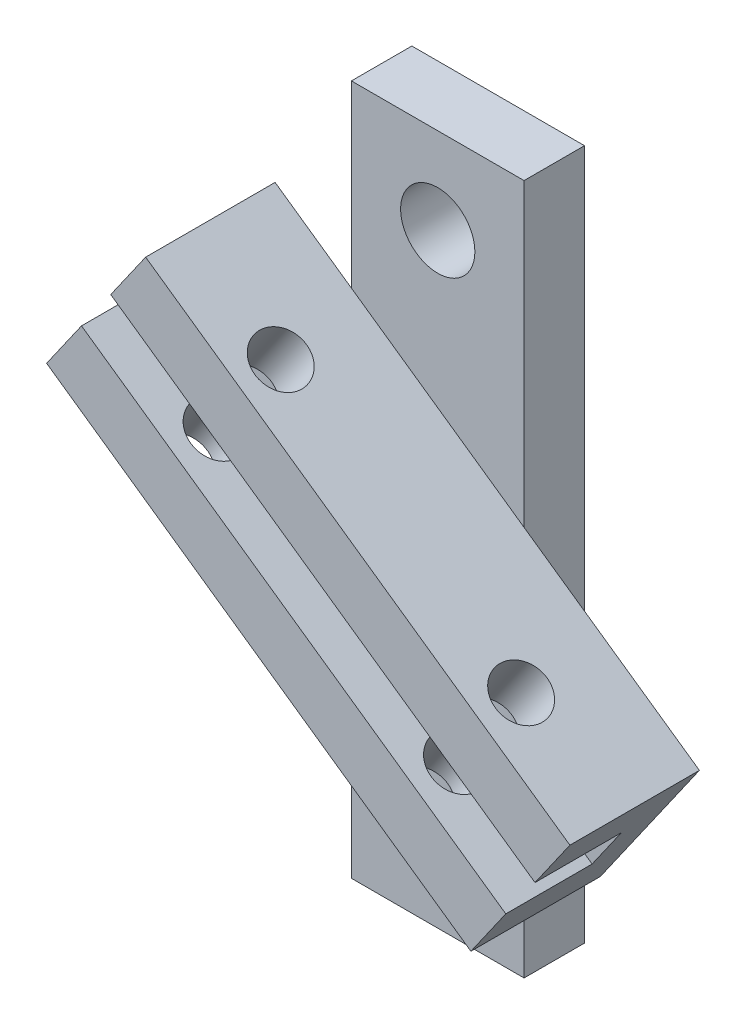
ISO-10303-21;
HEADER;
FILE_DESCRIPTION(('STEP AP214'),'2;1');
FILE_NAME('part.step','',(''),(''),'','','');
FILE_SCHEMA(('AUTOMOTIVE_DESIGN { 1 0 10303 214 1 1 1 1 }'));
ENDSEC;
DATA;
#1=APPLICATION_CONTEXT('core data for automotive mechanical design processes');
#2=APPLICATION_PROTOCOL_DEFINITION('international standard','automotive_design',2000,#1);
#3=PRODUCT_CONTEXT('',#1,'mechanical');
#4=PRODUCT('Part','Part','',(#3));
#5=PRODUCT_RELATED_PRODUCT_CATEGORY('part','',(#4));
#6=PRODUCT_DEFINITION_FORMATION('','',#4);
#7=PRODUCT_DEFINITION_CONTEXT('part definition',#1,'design');
#8=PRODUCT_DEFINITION('design','',#6,#7);
#9=PRODUCT_DEFINITION_SHAPE('','',#8);
#10=(LENGTH_UNIT() NAMED_UNIT(*) SI_UNIT(.MILLI.,.METRE.));
#11=(NAMED_UNIT(*) PLANE_ANGLE_UNIT() SI_UNIT($,.RADIAN.));
#12=(NAMED_UNIT(*) SI_UNIT($,.STERADIAN.) SOLID_ANGLE_UNIT());
#13=UNCERTAINTY_MEASURE_WITH_UNIT(LENGTH_MEASURE(1.E-05),#10,'distance_accuracy_value','');
#14=(GEOMETRIC_REPRESENTATION_CONTEXT(3) GLOBAL_UNCERTAINTY_ASSIGNED_CONTEXT((#13)) GLOBAL_UNIT_ASSIGNED_CONTEXT((#10,
#11,#12)) REPRESENTATION_CONTEXT('',''));
#15=CARTESIAN_POINT('',(0.,0.,0.));
#16=DIRECTION('',(0.,0.,1.));
#17=DIRECTION('',(1.,0.,0.));
#18=AXIS2_PLACEMENT_3D('',#15,#16,#17);
#19=CARTESIAN_POINT('',(0.,0.,22.));
#20=DIRECTION('',(0.,0.,1.));
#21=DIRECTION('',(1.,0.,0.));
#22=AXIS2_PLACEMENT_3D('',#19,#20,#21);
#23=PLANE('',#22);
#24=DIRECTION('',(-0.819152044288995,0.573576436351041,0.));
#25=VECTOR('',#24,1.);
#26=CARTESIAN_POINT('',(36.2666118159054,25.2092054401212,22.));
#27=LINE('',#26,#25);
#28=CARTESIAN_POINT('',(36.2666118159054,25.2092054401212,22.));
#29=VERTEX_POINT('',#28);
#30=CARTESIAN_POINT('',(-12.8825108414343,59.6237916211837,22.));
#31=VERTEX_POINT('',#30);
#32=EDGE_CURVE('E154',#29,#31,#27,.T.);
#33=ORIENTED_EDGE('',*,*,#32,.F.);
#34=DIRECTION('',(0.573576436351041,0.819152044288995,0.));
#35=VECTOR('',#34,1.);
#36=CARTESIAN_POINT('',(12.4908096295802,-8.74615906097435,22.));
#37=LINE('',#36,#35);
#38=CARTESIAN_POINT('',(40.3103256921802,30.9842273523587,22.));
#39=VERTEX_POINT('',#38);
#40=EDGE_CURVE('E175',#29,#39,#37,.T.);
#41=ORIENTED_EDGE('',*,*,#40,.T.);
#42=DIRECTION('',(-0.819152044288995,0.573576436351041,0.));
#43=VECTOR('',#42,1.);
#44=CARTESIAN_POINT('',(27.8195160626001,39.730386413333,22.));
#45=LINE('',#44,#43);
#46=CARTESIAN_POINT('',(-8.83879696515949,65.3988135334211,22.));
#47=VERTEX_POINT('',#46);
#48=EDGE_CURVE('E166',#39,#47,#45,.T.);
#49=ORIENTED_EDGE('',*,*,#48,.T.);
#50=DIRECTION('',(-0.573576436351041,-0.819152044288995,0.));
#51=VECTOR('',#50,1.);
#52=CARTESIAN_POINT('',(-36.6583130277595,25.6684271200881,22.));
#53=LINE('',#52,#51);
#54=EDGE_CURVE('E170',#47,#31,#53,.T.);
#55=ORIENTED_EDGE('',*,*,#54,.T.);
#56=EDGE_LOOP('',(#33,#41,#49,#55));
#57=FACE_BOUND('',#56,.T.);
#58=ADVANCED_FACE('F35',(#57),#23,.T.);
#59=CARTESIAN_POINT('',(0.,0.,7.));
#60=DIRECTION('',(0.,0.,-1.));
#61=DIRECTION('',(-1.,0.,0.));
#62=AXIS2_PLACEMENT_3D('',#59,#60,#61);
#63=PLANE('',#62);
#64=CARTESIAN_POINT('',(9.99999999999999,70.,7.));
#65=DIRECTION('',(0.,0.,1.));
#66=DIRECTION('',(1.,0.,0.));
#67=AXIS2_PLACEMENT_3D('',#64,#65,#66);
#68=CIRCLE('',#67,4.3);
#69=CARTESIAN_POINT('',(14.3,70.,7.));
#70=VERTEX_POINT('',#69);
#71=EDGE_CURVE('E206',#70,#70,#68,.T.);
#72=ORIENTED_EDGE('',*,*,#71,.F.);
#73=EDGE_LOOP('',(#72));
#74=FACE_BOUND('',#73,.T.);
#75=DIRECTION('',(-0.819152044288995,0.573576436351041,0.));
#76=VECTOR('',#75,1.);
#77=CARTESIAN_POINT('',(27.8195160626001,39.730386413333,7.));
#78=LINE('',#77,#76);
#79=CARTESIAN_POINT('',(20.,45.2056705055174,7.));
#80=VERTEX_POINT('',#79);
#81=CARTESIAN_POINT('',(0.,59.2098212697114,7.));
#82=VERTEX_POINT('',#81);
#83=EDGE_CURVE('E11',#80,#82,#78,.T.);
#84=ORIENTED_EDGE('',*,*,#83,.F.);
#85=DIRECTION('',(0.,1.,0.));
#86=VECTOR('',#85,1.);
#87=CARTESIAN_POINT('',(20.,0.,7.));
#88=LINE('',#87,#86);
#89=CARTESIAN_POINT('',(20.,80.,7.));
#90=VERTEX_POINT('',#89);
#91=EDGE_CURVE('E218',#80,#90,#88,.T.);
#92=ORIENTED_EDGE('',*,*,#91,.T.);
#93=DIRECTION('',(-1.,0.,0.));
#94=VECTOR('',#93,1.);
#95=CARTESIAN_POINT('',(0.,80.,7.));
#96=LINE('',#95,#94);
#97=CARTESIAN_POINT('',(0.,80.,7.));
#98=VERTEX_POINT('',#97);
#99=EDGE_CURVE('E221',#90,#98,#96,.T.);
#100=ORIENTED_EDGE('',*,*,#99,.T.);
#101=DIRECTION('',(0.,-1.,0.));
#102=VECTOR('',#101,1.);
#103=CARTESIAN_POINT('',(0.,0.,7.));
#104=LINE('',#103,#102);
#105=EDGE_CURVE('E212',#98,#82,#104,.T.);
#106=ORIENTED_EDGE('',*,*,#105,.T.);
#107=EDGE_LOOP('',(#84,#92,#100,#106));
#108=FACE_BOUND('',#107,.T.);
#109=ADVANCED_FACE('F336',(#74,#108),#63,.F.);
#110=CARTESIAN_POINT('',(10.,9.99999999999999,7.));
#111=DIRECTION('',(0.,0.,1.));
#112=DIRECTION('',(-1.,0.,0.));
#113=AXIS2_PLACEMENT_3D('',#110,#111,#112);
#114=CIRCLE('',#113,4.3);
#115=CARTESIAN_POINT('',(5.70000000000001,9.99999999999999,7.));
#116=VERTEX_POINT('',#115);
#117=EDGE_CURVE('E200',#116,#116,#114,.T.);
#118=ORIENTED_EDGE('',*,*,#117,.F.);
#119=EDGE_LOOP('',(#118));
#120=FACE_BOUND('',#119,.T.);
#121=DIRECTION('',(0.819152044288995,-0.573576436351041,0.));
#122=VECTOR('',#121,1.);
#123=CARTESIAN_POINT('',(16.3479873355792,23.3473455275531,7.));
#124=LINE('',#123,#122);
#125=CARTESIAN_POINT('',(0.,34.7943294944824,7.));
#126=VERTEX_POINT('',#125);
#127=CARTESIAN_POINT('',(20.,20.7901787302884,7.));
#128=VERTEX_POINT('',#127);
#129=EDGE_CURVE('E44',#126,#128,#124,.T.);
#130=ORIENTED_EDGE('',*,*,#129,.F.);
#131=CARTESIAN_POINT('',(0.,0.,7.));
#132=VERTEX_POINT('',#131);
#133=EDGE_CURVE('E216',#126,#132,#104,.T.);
#134=ORIENTED_EDGE('',*,*,#133,.T.);
#135=DIRECTION('',(1.,0.,0.));
#136=VECTOR('',#135,1.);
#137=CARTESIAN_POINT('',(0.,0.,7.));
#138=LINE('',#137,#136);
#139=CARTESIAN_POINT('',(20.,0.,7.));
#140=VERTEX_POINT('',#139);
#141=EDGE_CURVE('E214',#132,#140,#138,.T.);
#142=ORIENTED_EDGE('',*,*,#141,.T.);
#143=EDGE_CURVE('E219',#140,#128,#88,.T.);
#144=ORIENTED_EDGE('',*,*,#143,.T.);
#145=EDGE_LOOP('',(#130,#134,#142,#144));
#146=FACE_BOUND('',#145,.T.);
#147=ADVANCED_FACE('F300',(#120,#146),#63,.F.);
#148=CARTESIAN_POINT('',(0.,0.,0.));
#149=DIRECTION('',(0.,0.,-1.));
#150=DIRECTION('',(-1.,0.,0.));
#151=AXIS2_PLACEMENT_3D('',#148,#149,#150);
#152=PLANE('',#151);
#153=CARTESIAN_POINT('',(9.99999999999999,70.,0.));
#154=DIRECTION('',(0.,0.,1.));
#155=DIRECTION('',(1.,0.,0.));
#156=AXIS2_PLACEMENT_3D('',#153,#154,#155);
#157=CIRCLE('',#156,4.3);
#158=CARTESIAN_POINT('',(14.3,70.,0.));
#159=VERTEX_POINT('',#158);
#160=EDGE_CURVE('E203',#159,#159,#157,.T.);
#161=ORIENTED_EDGE('',*,*,#160,.T.);
#162=EDGE_LOOP('',(#161));
#163=FACE_BOUND('',#162,.T.);
#164=DIRECTION('',(0.,-1.,0.));
#165=VECTOR('',#164,1.);
#166=CARTESIAN_POINT('',(0.,0.,0.));
#167=LINE('',#166,#165);
#168=CARTESIAN_POINT('',(0.,80.,0.));
#169=VERTEX_POINT('',#168);
#170=CARTESIAN_POINT('',(0.,0.,0.));
#171=VERTEX_POINT('',#170);
#172=EDGE_CURVE('E209',#169,#171,#167,.T.);
#173=ORIENTED_EDGE('',*,*,#172,.F.);
#174=DIRECTION('',(-1.,0.,0.));
#175=VECTOR('',#174,1.);
#176=CARTESIAN_POINT('',(0.,80.,0.));
#177=LINE('',#176,#175);
#178=CARTESIAN_POINT('',(20.,80.,0.));
#179=VERTEX_POINT('',#178);
#180=EDGE_CURVE('E231',#179,#169,#177,.T.);
#181=ORIENTED_EDGE('',*,*,#180,.F.);
#182=DIRECTION('',(0.,1.,0.));
#183=VECTOR('',#182,1.);
#184=CARTESIAN_POINT('',(20.,0.,0.));
#185=LINE('',#184,#183);
#186=CARTESIAN_POINT('',(20.,0.,0.));
#187=VERTEX_POINT('',#186);
#188=EDGE_CURVE('E229',#187,#179,#185,.T.);
#189=ORIENTED_EDGE('',*,*,#188,.F.);
#190=DIRECTION('',(1.,0.,0.));
#191=VECTOR('',#190,1.);
#192=CARTESIAN_POINT('',(0.,0.,0.));
#193=LINE('',#192,#191);
#194=EDGE_CURVE('E227',#171,#187,#193,.T.);
#195=ORIENTED_EDGE('',*,*,#194,.F.);
#196=EDGE_LOOP('',(#173,#181,#189,#195));
#197=FACE_BOUND('',#196,.T.);
#198=CARTESIAN_POINT('',(10.,9.99999999999999,0.));
#199=DIRECTION('',(0.,0.,1.));
#200=DIRECTION('',(-1.,0.,0.));
#201=AXIS2_PLACEMENT_3D('',#198,#199,#200);
#202=CIRCLE('',#201,4.3);
#203=CARTESIAN_POINT('',(5.70000000000001,9.99999999999999,0.));
#204=VERTEX_POINT('',#203);
#205=EDGE_CURVE('E199',#204,#204,#202,.T.);
#206=ORIENTED_EDGE('',*,*,#205,.T.);
#207=EDGE_LOOP('',(#206));
#208=FACE_BOUND('',#207,.T.);
#209=ADVANCED_FACE('F310',(#163,#197,#208),#152,.T.);
#210=CARTESIAN_POINT('',(0.,0.,7.));
#211=DIRECTION('',(1.,0.,0.));
#212=DIRECTION('',(0.,0.,-1.));
#213=AXIS2_PLACEMENT_3D('',#210,#211,#212);
#214=PLANE('',#213);
#215=ORIENTED_EDGE('',*,*,#172,.T.);
#216=DIRECTION('',(0.,0.,-1.));
#217=VECTOR('',#216,1.);
#218=CARTESIAN_POINT('',(0.,0.,7.));
#219=LINE('',#218,#217);
#220=EDGE_CURVE('E241',#132,#171,#219,.T.);
#221=ORIENTED_EDGE('',*,*,#220,.F.);
#222=ORIENTED_EDGE('',*,*,#133,.F.);
#223=EDGE_CURVE('E215',#82,#126,#104,.T.);
#224=ORIENTED_EDGE('',*,*,#223,.F.);
#225=ORIENTED_EDGE('',*,*,#105,.F.);
#226=DIRECTION('',(0.,0.,-1.));
#227=VECTOR('',#226,1.);
#228=CARTESIAN_POINT('',(0.,80.,7.));
#229=LINE('',#228,#227);
#230=EDGE_CURVE('E224',#98,#169,#229,.T.);
#231=ORIENTED_EDGE('',*,*,#230,.T.);
#232=EDGE_LOOP('',(#215,#221,#222,#224,#225,#231));
#233=FACE_BOUND('',#232,.T.);
#234=ADVANCED_FACE('F37',(#233),#214,.F.);
#235=CARTESIAN_POINT('',(0.,0.,7.));
#236=DIRECTION('',(0.,1.,0.));
#237=DIRECTION('',(0.,0.,1.));
#238=AXIS2_PLACEMENT_3D('',#235,#236,#237);
#239=PLANE('',#238);
#240=ORIENTED_EDGE('',*,*,#194,.T.);
#241=DIRECTION('',(0.,0.,-1.));
#242=VECTOR('',#241,1.);
#243=CARTESIAN_POINT('',(20.,0.,7.));
#244=LINE('',#243,#242);
#245=EDGE_CURVE('E238',#140,#187,#244,.T.);
#246=ORIENTED_EDGE('',*,*,#245,.F.);
#247=ORIENTED_EDGE('',*,*,#141,.F.);
#248=ORIENTED_EDGE('',*,*,#220,.T.);
#249=EDGE_LOOP('',(#240,#246,#247,#248));
#250=FACE_BOUND('',#249,.T.);
#251=ADVANCED_FACE('F304',(#250),#239,.F.);
#252=CARTESIAN_POINT('',(20.,0.,7.));
#253=DIRECTION('',(-1.,0.,0.));
#254=DIRECTION('',(0.,-1.,0.));
#255=AXIS2_PLACEMENT_3D('',#252,#253,#254);
#256=PLANE('',#255);
#257=ORIENTED_EDGE('',*,*,#188,.T.);
#258=DIRECTION('',(0.,0.,-1.));
#259=VECTOR('',#258,1.);
#260=CARTESIAN_POINT('',(20.,80.,7.));
#261=LINE('',#260,#259);
#262=EDGE_CURVE('E235',#90,#179,#261,.T.);
#263=ORIENTED_EDGE('',*,*,#262,.F.);
#264=ORIENTED_EDGE('',*,*,#91,.F.);
#265=EDGE_CURVE('E222',#128,#80,#88,.T.);
#266=ORIENTED_EDGE('',*,*,#265,.F.);
#267=ORIENTED_EDGE('',*,*,#143,.F.);
#268=ORIENTED_EDGE('',*,*,#245,.T.);
#269=EDGE_LOOP('',(#257,#263,#264,#266,#267,#268));
#270=FACE_BOUND('',#269,.T.);
#271=ADVANCED_FACE('F314',(#270),#256,.F.);
#272=CARTESIAN_POINT('',(0.,80.,7.));
#273=DIRECTION('',(0.,-1.,0.));
#274=DIRECTION('',(0.,0.,-1.));
#275=AXIS2_PLACEMENT_3D('',#272,#273,#274);
#276=PLANE('',#275);
#277=ORIENTED_EDGE('',*,*,#180,.T.);
#278=ORIENTED_EDGE('',*,*,#230,.F.);
#279=ORIENTED_EDGE('',*,*,#99,.F.);
#280=ORIENTED_EDGE('',*,*,#262,.T.);
#281=EDGE_LOOP('',(#277,#278,#279,#280));
#282=FACE_BOUND('',#281,.T.);
#283=ADVANCED_FACE('F354',(#282),#276,.F.);
#284=CARTESIAN_POINT('',(9.99999999999999,70.,7.));
#285=DIRECTION('',(0.,0.,-1.));
#286=DIRECTION('',(-1.,0.,0.));
#287=AXIS2_PLACEMENT_3D('',#284,#285,#286);
#288=CYLINDRICAL_SURFACE('',#287,4.3);
#289=ORIENTED_EDGE('',*,*,#71,.T.);
#290=EDGE_LOOP('',(#289));
#291=FACE_BOUND('',#290,.T.);
#292=ORIENTED_EDGE('',*,*,#160,.F.);
#293=EDGE_LOOP('',(#292));
#294=FACE_BOUND('',#293,.T.);
#295=ADVANCED_FACE('F349',(#291,#294),#288,.F.);
#296=CARTESIAN_POINT('',(10.,9.99999999999999,7.));
#297=DIRECTION('',(0.,0.,-1.));
#298=DIRECTION('',(-1.,0.,0.));
#299=AXIS2_PLACEMENT_3D('',#296,#297,#298);
#300=CYLINDRICAL_SURFACE('',#299,4.3);
#301=ORIENTED_EDGE('',*,*,#117,.T.);
#302=EDGE_LOOP('',(#301));
#303=FACE_BOUND('',#302,.T.);
#304=ORIENTED_EDGE('',*,*,#205,.F.);
#305=EDGE_LOOP('',(#304));
#306=FACE_BOUND('',#305,.T.);
#307=ADVANCED_FACE('F385',(#303,#306),#300,.F.);
#308=CARTESIAN_POINT('',(0.,0.,7.));
#309=DIRECTION('',(0.,0.,1.));
#310=DIRECTION('',(1.,0.,0.));
#311=AXIS2_PLACEMENT_3D('',#308,#309,#310);
#312=PLANE('',#311);
#313=CARTESIAN_POINT('',(-8.83879696515949,65.3988135334211,7.));
#314=VERTEX_POINT('',#313);
#315=EDGE_CURVE('E47',#82,#314,#78,.T.);
#316=ORIENTED_EDGE('',*,*,#315,.F.);
#317=ORIENTED_EDGE('',*,*,#223,.T.);
#318=CARTESIAN_POINT('',(-20.3103256921803,49.0157726476412,7.));
#319=VERTEX_POINT('',#318);
#320=EDGE_CURVE('E184',#319,#126,#124,.T.);
#321=ORIENTED_EDGE('',*,*,#320,.F.);
#322=DIRECTION('',(-0.573576436351041,-0.819152044288995,0.));
#323=VECTOR('',#322,1.);
#324=CARTESIAN_POINT('',(-36.6583130277595,25.6684271200881,7.));
#325=LINE('',#324,#323);
#326=EDGE_CURVE('E181',#314,#319,#325,.T.);
#327=ORIENTED_EDGE('',*,*,#326,.F.);
#328=EDGE_LOOP('',(#316,#317,#321,#327));
#329=FACE_BOUND('',#328,.T.);
#330=ADVANCED_FACE('F294',(#329),#312,.F.);
#331=CARTESIAN_POINT('',(28.8387969651594,14.6011864665788,7.));
#332=VERTEX_POINT('',#331);
#333=EDGE_CURVE('E183',#128,#332,#124,.T.);
#334=ORIENTED_EDGE('',*,*,#333,.F.);
#335=ORIENTED_EDGE('',*,*,#265,.T.);
#336=CARTESIAN_POINT('',(40.3103256921802,30.9842273523587,7.));
#337=VERTEX_POINT('',#336);
#338=EDGE_CURVE('E46',#337,#80,#78,.T.);
#339=ORIENTED_EDGE('',*,*,#338,.F.);
#340=DIRECTION('',(0.573576436351041,0.819152044288995,0.));
#341=VECTOR('',#340,1.);
#342=CARTESIAN_POINT('',(12.4908096295802,-8.74615906097435,7.));
#343=LINE('',#342,#341);
#344=EDGE_CURVE('E169',#332,#337,#343,.T.);
#345=ORIENTED_EDGE('',*,*,#344,.F.);
#346=EDGE_LOOP('',(#334,#335,#339,#345));
#347=FACE_BOUND('',#346,.T.);
#348=ADVANCED_FACE('F320',(#347),#312,.F.);
#349=CARTESIAN_POINT('',(27.8195160626001,39.730386413333,22.));
#350=DIRECTION('',(-0.573576436351041,-0.819152044288995,0.));
#351=DIRECTION('',(0.819152044288995,-0.573576436351041,0.));
#352=AXIS2_PLACEMENT_3D('',#349,#350,#351);
#353=PLANE('',#352);
#354=CARTESIAN_POINT('',(29.6613491164233,38.4407210249222,17.));
#355=DIRECTION('',(0.573576436351041,0.819152044288995,0.));
#356=DIRECTION('',(-0.819152044288995,0.573576436351041,0.));
#357=AXIS2_PLACEMENT_3D('',#354,#355,#356);
#358=CIRCLE('',#357,2.99999999999999);
#359=CARTESIAN_POINT('',(27.2038929835563,40.1614503339753,17.));
#360=VERTEX_POINT('',#359);
#361=EDGE_CURVE('E540',#360,#360,#358,.T.);
#362=ORIENTED_EDGE('',*,*,#361,.F.);
#363=EDGE_LOOP('',(#362));
#364=FACE_BOUND('',#363,.T.);
#365=CARTESIAN_POINT('',(1.81017961059745,57.9423198608576,17.));
#366=DIRECTION('',(0.573576436351041,0.819152044288995,0.));
#367=DIRECTION('',(-0.819152044288995,0.573576436351041,0.));
#368=AXIS2_PLACEMENT_3D('',#365,#366,#367);
#369=CIRCLE('',#368,2.99999999999999);
#370=CARTESIAN_POINT('',(-0.647276522269531,59.6630491699107,17.));
#371=VERTEX_POINT('',#370);
#372=EDGE_CURVE('E246',#371,#371,#369,.T.);
#373=ORIENTED_EDGE('',*,*,#372,.F.);
#374=EDGE_LOOP('',(#373));
#375=FACE_BOUND('',#374,.T.);
#376=ORIENTED_EDGE('',*,*,#338,.T.);
#377=ORIENTED_EDGE('',*,*,#83,.T.);
#378=ORIENTED_EDGE('',*,*,#315,.T.);
#379=DIRECTION('',(0.,0.,-1.));
#380=VECTOR('',#379,1.);
#381=CARTESIAN_POINT('',(-8.83879696515949,65.3988135334211,22.));
#382=LINE('',#381,#380);
#383=EDGE_CURVE('E196',#47,#314,#382,.T.);
#384=ORIENTED_EDGE('',*,*,#383,.F.);
#385=ORIENTED_EDGE('',*,*,#48,.F.);
#386=DIRECTION('',(0.,0.,-1.));
#387=VECTOR('',#386,1.);
#388=CARTESIAN_POINT('',(40.3103256921802,30.9842273523587,22.));
#389=LINE('',#388,#387);
#390=EDGE_CURVE('E178',#39,#337,#389,.T.);
#391=ORIENTED_EDGE('',*,*,#390,.T.);
#392=EDGE_LOOP('',(#376,#377,#378,#384,#385,#391));
#393=FACE_BOUND('',#392,.T.);
#394=ADVANCED_FACE('F283',(#364,#375,#393),#353,.F.);
#395=CARTESIAN_POINT('',(-36.6583130277595,25.6684271200881,22.));
#396=DIRECTION('',(0.819152044288995,-0.573576436351041,0.));
#397=DIRECTION('',(0.573576436351041,0.819152044288995,0.));
#398=AXIS2_PLACEMENT_3D('',#395,#396,#397);
#399=PLANE('',#398);
#400=DIRECTION('',(-0.573576436351041,-0.819152044288995,0.));
#401=VECTOR('',#400,1.);
#402=CARTESIAN_POINT('',(-12.8825108414343,59.6237916211837,12.));
#403=LINE('',#402,#401);
#404=CARTESIAN_POINT('',(-12.8825108414343,59.6237916211837,12.));
#405=VERTEX_POINT('',#404);
#406=CARTESIAN_POINT('',(-16.2666118159055,54.7907945598787,12.));
#407=VERTEX_POINT('',#406);
#408=EDGE_CURVE('E145',#405,#407,#403,.T.);
#409=ORIENTED_EDGE('',*,*,#408,.F.);
#410=DIRECTION('',(0.,0.,1.));
#411=VECTOR('',#410,1.);
#412=CARTESIAN_POINT('',(-12.8825108414343,59.6237916211837,12.));
#413=LINE('',#412,#411);
#414=EDGE_CURVE('E268',#405,#31,#413,.T.);
#415=ORIENTED_EDGE('',*,*,#414,.T.);
#416=ORIENTED_EDGE('',*,*,#54,.F.);
#417=ORIENTED_EDGE('',*,*,#383,.T.);
#418=ORIENTED_EDGE('',*,*,#326,.T.);
#419=DIRECTION('',(0.,0.,-1.));
#420=VECTOR('',#419,1.);
#421=CARTESIAN_POINT('',(-20.3103256921803,49.0157726476412,22.));
#422=LINE('',#421,#420);
#423=CARTESIAN_POINT('',(-20.3103256921803,49.0157726476412,22.));
#424=VERTEX_POINT('',#423);
#425=EDGE_CURVE('E193',#424,#319,#422,.T.);
#426=ORIENTED_EDGE('',*,*,#425,.F.);
#427=CARTESIAN_POINT('',(-16.2666118159055,54.7907945598787,22.));
#428=VERTEX_POINT('',#427);
#429=EDGE_CURVE('E159',#428,#424,#53,.T.);
#430=ORIENTED_EDGE('',*,*,#429,.F.);
#431=DIRECTION('',(0.,0.,1.));
#432=VECTOR('',#431,1.);
#433=CARTESIAN_POINT('',(-16.2666118159055,54.7907945598787,12.));
#434=LINE('',#433,#432);
#435=EDGE_CURVE('E54',#407,#428,#434,.T.);
#436=ORIENTED_EDGE('',*,*,#435,.F.);
#437=EDGE_LOOP('',(#409,#415,#416,#417,#418,#426,#430,#436));
#438=FACE_BOUND('',#437,.T.);
#439=ADVANCED_FACE('F157',(#438),#399,.F.);
#440=CARTESIAN_POINT('',(16.3479873355792,23.3473455275531,22.));
#441=DIRECTION('',(0.573576436351041,0.819152044288995,0.));
#442=DIRECTION('',(-0.819152044288995,0.573576436351041,0.));
#443=AXIS2_PLACEMENT_3D('',#440,#441,#442);
#444=PLANE('',#443);
#445=CARTESIAN_POINT('',(18.1898203894025,22.0576801391423,17.));
#446=DIRECTION('',(0.573576436351041,0.819152044288995,0.));
#447=DIRECTION('',(-0.819152044288995,0.573576436351041,0.));
#448=AXIS2_PLACEMENT_3D('',#445,#446,#447);
#449=CIRCLE('',#448,2.99999999999999);
#450=CARTESIAN_POINT('',(15.7323642565355,23.7784094481954,17.));
#451=VERTEX_POINT('',#450);
#452=EDGE_CURVE('E39',#451,#451,#449,.T.);
#453=ORIENTED_EDGE('',*,*,#452,.T.);
#454=EDGE_LOOP('',(#453));
#455=FACE_BOUND('',#454,.T.);
#456=CARTESIAN_POINT('',(-9.66134911642337,41.5592789750777,17.));
#457=DIRECTION('',(0.573576436351041,0.819152044288995,0.));
#458=DIRECTION('',(-0.819152044288995,0.573576436351041,0.));
#459=AXIS2_PLACEMENT_3D('',#456,#457,#458);
#460=CIRCLE('',#459,2.99999999999999);
#461=CARTESIAN_POINT('',(-12.1188052492903,43.2800082841308,17.));
#462=VERTEX_POINT('',#461);
#463=EDGE_CURVE('E243',#462,#462,#460,.T.);
#464=ORIENTED_EDGE('',*,*,#463,.T.);
#465=EDGE_LOOP('',(#464));
#466=FACE_BOUND('',#465,.T.);
#467=ORIENTED_EDGE('',*,*,#320,.T.);
#468=ORIENTED_EDGE('',*,*,#129,.T.);
#469=ORIENTED_EDGE('',*,*,#333,.T.);
#470=DIRECTION('',(0.,0.,-1.));
#471=VECTOR('',#470,1.);
#472=CARTESIAN_POINT('',(28.8387969651594,14.6011864665788,22.));
#473=LINE('',#472,#471);
#474=CARTESIAN_POINT('',(28.8387969651594,14.6011864665788,22.));
#475=VERTEX_POINT('',#474);
#476=EDGE_CURVE('E190',#475,#332,#473,.T.);
#477=ORIENTED_EDGE('',*,*,#476,.F.);
#478=DIRECTION('',(0.819152044288995,-0.573576436351041,0.));
#479=VECTOR('',#478,1.);
#480=CARTESIAN_POINT('',(16.3479873355792,23.3473455275531,22.));
#481=LINE('',#480,#479);
#482=EDGE_CURVE('E173',#424,#475,#481,.T.);
#483=ORIENTED_EDGE('',*,*,#482,.F.);
#484=ORIENTED_EDGE('',*,*,#425,.T.);
#485=EDGE_LOOP('',(#467,#468,#469,#477,#483,#484));
#486=FACE_BOUND('',#485,.T.);
#487=ADVANCED_FACE('F290',(#455,#466,#486),#444,.F.);
#488=CARTESIAN_POINT('',(12.4908096295802,-8.74615906097435,22.));
#489=DIRECTION('',(-0.819152044288995,0.573576436351041,0.));
#490=DIRECTION('',(-0.573576436351041,-0.819152044288995,0.));
#491=AXIS2_PLACEMENT_3D('',#488,#489,#490);
#492=PLANE('',#491);
#493=ORIENTED_EDGE('',*,*,#40,.F.);
#494=DIRECTION('',(0.,0.,1.));
#495=VECTOR('',#494,1.);
#496=CARTESIAN_POINT('',(36.2666118159054,25.2092054401212,12.));
#497=LINE('',#496,#495);
#498=CARTESIAN_POINT('',(36.2666118159054,25.2092054401212,12.));
#499=VERTEX_POINT('',#498);
#500=EDGE_CURVE('E161',#499,#29,#497,.T.);
#501=ORIENTED_EDGE('',*,*,#500,.F.);
#502=DIRECTION('',(0.573576436351042,0.819152044288995,0.));
#503=VECTOR('',#502,1.);
#504=CARTESIAN_POINT('',(32.8825108414342,20.3762083788162,12.));
#505=LINE('',#504,#503);
#506=CARTESIAN_POINT('',(32.8825108414342,20.3762083788162,12.));
#507=VERTEX_POINT('',#506);
#508=EDGE_CURVE('E144',#507,#499,#505,.T.);
#509=ORIENTED_EDGE('',*,*,#508,.F.);
#510=DIRECTION('',(0.,0.,1.));
#511=VECTOR('',#510,1.);
#512=CARTESIAN_POINT('',(32.8825108414342,20.3762083788162,12.));
#513=LINE('',#512,#511);
#514=CARTESIAN_POINT('',(32.8825108414342,20.3762083788162,22.));
#515=VERTEX_POINT('',#514);
#516=EDGE_CURVE('E141',#507,#515,#513,.T.);
#517=ORIENTED_EDGE('',*,*,#516,.T.);
#518=EDGE_CURVE('E176',#475,#515,#37,.T.);
#519=ORIENTED_EDGE('',*,*,#518,.F.);
#520=ORIENTED_EDGE('',*,*,#476,.T.);
#521=ORIENTED_EDGE('',*,*,#344,.T.);
#522=ORIENTED_EDGE('',*,*,#390,.F.);
#523=EDGE_LOOP('',(#493,#501,#509,#517,#519,#520,#521,#522));
#524=FACE_BOUND('',#523,.T.);
#525=ADVANCED_FACE('F277',(#524),#492,.F.);
#526=DIRECTION('',(0.819152044288995,-0.573576436351041,0.));
#527=VECTOR('',#526,1.);
#528=CARTESIAN_POINT('',(-16.2666118159055,54.7907945598787,22.));
#529=LINE('',#528,#527);
#530=EDGE_CURVE('E263',#428,#515,#529,.T.);
#531=ORIENTED_EDGE('',*,*,#530,.F.);
#532=ORIENTED_EDGE('',*,*,#429,.T.);
#533=ORIENTED_EDGE('',*,*,#482,.T.);
#534=ORIENTED_EDGE('',*,*,#518,.T.);
#535=EDGE_LOOP('',(#531,#532,#533,#534));
#536=FACE_BOUND('',#535,.T.);
#537=ADVANCED_FACE('F323',(#536),#23,.T.);
#538=CARTESIAN_POINT('',(36.2666118159054,25.2092054401212,12.));
#539=DIRECTION('',(0.573576436351041,0.819152044288995,0.));
#540=DIRECTION('',(-0.819152044288995,0.573576436351041,0.));
#541=AXIS2_PLACEMENT_3D('',#538,#539,#540);
#542=PLANE('',#541);
#543=CARTESIAN_POINT('',(25.6176352401484,32.6656991126848,17.));
#544=DIRECTION('',(0.573576436351041,0.819152044288995,0.));
#545=DIRECTION('',(-0.819152044288995,0.573576436351041,0.));
#546=AXIS2_PLACEMENT_3D('',#543,#544,#545);
#547=CIRCLE('',#546,2.99999999999999);
#548=CARTESIAN_POINT('',(23.1601791072815,34.3864284217379,17.));
#549=VERTEX_POINT('',#548);
#550=EDGE_CURVE('E253',#549,#549,#547,.T.);
#551=ORIENTED_EDGE('',*,*,#550,.T.);
#552=EDGE_LOOP('',(#551));
#553=FACE_BOUND('',#552,.T.);
#554=CARTESIAN_POINT('',(-2.23353426567739,52.1672979486202,17.));
#555=DIRECTION('',(0.573576436351041,0.819152044288995,0.));
#556=DIRECTION('',(-0.819152044288995,0.573576436351041,0.));
#557=AXIS2_PLACEMENT_3D('',#554,#555,#556);
#558=CIRCLE('',#557,2.99999999999999);
#559=CARTESIAN_POINT('',(-4.69099039854437,53.8880272576733,17.));
#560=VERTEX_POINT('',#559);
#561=EDGE_CURVE('E250',#560,#560,#558,.T.);
#562=ORIENTED_EDGE('',*,*,#561,.T.);
#563=EDGE_LOOP('',(#562));
#564=FACE_BOUND('',#563,.T.);
#565=ORIENTED_EDGE('',*,*,#32,.T.);
#566=ORIENTED_EDGE('',*,*,#414,.F.);
#567=DIRECTION('',(-0.819152044288995,0.573576436351041,0.));
#568=VECTOR('',#567,1.);
#569=CARTESIAN_POINT('',(36.2666118159054,25.2092054401212,12.));
#570=LINE('',#569,#568);
#571=EDGE_CURVE('E151',#499,#405,#570,.T.);
#572=ORIENTED_EDGE('',*,*,#571,.F.);
#573=ORIENTED_EDGE('',*,*,#500,.T.);
#574=EDGE_LOOP('',(#565,#566,#572,#573));
#575=FACE_BOUND('',#574,.T.);
#576=ADVANCED_FACE('F272',(#553,#564,#575),#542,.F.);
#577=CARTESIAN_POINT('',(-16.2666118159055,54.7907945598787,12.));
#578=DIRECTION('',(-0.573576436351041,-0.819152044288995,0.));
#579=DIRECTION('',(0.819152044288995,-0.573576436351041,0.));
#580=AXIS2_PLACEMENT_3D('',#577,#578,#579);
#581=PLANE('',#580);
#582=CARTESIAN_POINT('',(22.2335342656773,27.8327020513797,17.));
#583=DIRECTION('',(-0.573576436351041,-0.819152044288995,0.));
#584=DIRECTION('',(0.819152044288995,-0.573576436351041,0.));
#585=AXIS2_PLACEMENT_3D('',#582,#583,#584);
#586=CIRCLE('',#585,2.99999999999999);
#587=CARTESIAN_POINT('',(24.6909903985443,26.1119727423266,17.));
#588=VERTEX_POINT('',#587);
#589=EDGE_CURVE('E258',#588,#588,#586,.T.);
#590=ORIENTED_EDGE('',*,*,#589,.T.);
#591=EDGE_LOOP('',(#590));
#592=FACE_BOUND('',#591,.T.);
#593=CARTESIAN_POINT('',(-5.61763524014853,47.3343008873151,17.));
#594=DIRECTION('',(-0.573576436351041,-0.819152044288995,0.));
#595=DIRECTION('',(0.819152044288995,-0.573576436351041,0.));
#596=AXIS2_PLACEMENT_3D('',#593,#594,#595);
#597=CIRCLE('',#596,2.99999999999999);
#598=CARTESIAN_POINT('',(-3.16017910728156,45.613571578262,17.));
#599=VERTEX_POINT('',#598);
#600=EDGE_CURVE('E245',#599,#599,#597,.T.);
#601=ORIENTED_EDGE('',*,*,#600,.T.);
#602=EDGE_LOOP('',(#601));
#603=FACE_BOUND('',#602,.T.);
#604=ORIENTED_EDGE('',*,*,#530,.T.);
#605=ORIENTED_EDGE('',*,*,#516,.F.);
#606=DIRECTION('',(0.819152044288995,-0.573576436351041,0.));
#607=VECTOR('',#606,1.);
#608=CARTESIAN_POINT('',(-16.2666118159055,54.7907945598787,12.));
#609=LINE('',#608,#607);
#610=EDGE_CURVE('E137',#407,#507,#609,.T.);
#611=ORIENTED_EDGE('',*,*,#610,.F.);
#612=ORIENTED_EDGE('',*,*,#435,.T.);
#613=EDGE_LOOP('',(#604,#605,#611,#612));
#614=FACE_BOUND('',#613,.T.);
#615=ADVANCED_FACE('F139',(#592,#603,#614),#581,.F.);
#616=CARTESIAN_POINT('',(0.,0.,12.));
#617=DIRECTION('',(0.,0.,1.));
#618=DIRECTION('',(1.,0.,0.));
#619=AXIS2_PLACEMENT_3D('',#616,#617,#618);
#620=PLANE('',#619);
#621=ORIENTED_EDGE('',*,*,#408,.T.);
#622=ORIENTED_EDGE('',*,*,#610,.T.);
#623=ORIENTED_EDGE('',*,*,#508,.T.);
#624=ORIENTED_EDGE('',*,*,#571,.T.);
#625=EDGE_LOOP('',(#621,#622,#623,#624));
#626=FACE_BOUND('',#625,.T.);
#627=ADVANCED_FACE('F149',(#626),#620,.T.);
#628=CARTESIAN_POINT('',(1.81017961059745,57.9423198608576,17.));
#629=DIRECTION('',(0.573576436351041,0.819152044288995,0.));
#630=DIRECTION('',(-0.819152044288995,0.573576436351041,0.));
#631=AXIS2_PLACEMENT_3D('',#628,#629,#630);
#632=CYLINDRICAL_SURFACE('',#631,2.99999999999999);
#633=ORIENTED_EDGE('',*,*,#463,.F.);
#634=EDGE_LOOP('',(#633));
#635=FACE_BOUND('',#634,.T.);
#636=ORIENTED_EDGE('',*,*,#600,.F.);
#637=EDGE_LOOP('',(#636));
#638=FACE_BOUND('',#637,.T.);
#639=ADVANCED_FACE('F470',(#635,#638),#632,.F.);
#640=ORIENTED_EDGE('',*,*,#372,.T.);
#641=EDGE_LOOP('',(#640));
#642=FACE_BOUND('',#641,.T.);
#643=ORIENTED_EDGE('',*,*,#561,.F.);
#644=EDGE_LOOP('',(#643));
#645=FACE_BOUND('',#644,.T.);
#646=ADVANCED_FACE('F506',(#642,#645),#632,.F.);
#647=CARTESIAN_POINT('',(29.6613491164233,38.4407210249222,17.));
#648=DIRECTION('',(0.573576436351041,0.819152044288995,0.));
#649=DIRECTION('',(-0.819152044288995,0.573576436351041,0.));
#650=AXIS2_PLACEMENT_3D('',#647,#648,#649);
#651=CYLINDRICAL_SURFACE('',#650,2.99999999999999);
#652=ORIENTED_EDGE('',*,*,#452,.F.);
#653=EDGE_LOOP('',(#652));
#654=FACE_BOUND('',#653,.T.);
#655=ORIENTED_EDGE('',*,*,#589,.F.);
#656=EDGE_LOOP('',(#655));
#657=FACE_BOUND('',#656,.T.);
#658=ADVANCED_FACE('F516',(#654,#657),#651,.F.);
#659=ORIENTED_EDGE('',*,*,#361,.T.);
#660=EDGE_LOOP('',(#659));
#661=FACE_BOUND('',#660,.T.);
#662=ORIENTED_EDGE('',*,*,#550,.F.);
#663=EDGE_LOOP('',(#662));
#664=FACE_BOUND('',#663,.T.);
#665=ADVANCED_FACE('F524',(#661,#664),#651,.F.);
#666=CLOSED_SHELL('',(#58,#109,#147,#209,#234,#251,#271,#283,#295,#307,#330,#348,#394,#439,#487,
#525,#537,#576,#615,#627,#639,#646,#658,#665));
#667=MANIFOLD_SOLID_BREP('B2',#666);
#668=ADVANCED_BREP_SHAPE_REPRESENTATION('',(#18,#667),#14);
#669=SHAPE_DEFINITION_REPRESENTATION(#9,#668);
ENDSEC;
END-ISO-10303-21;
